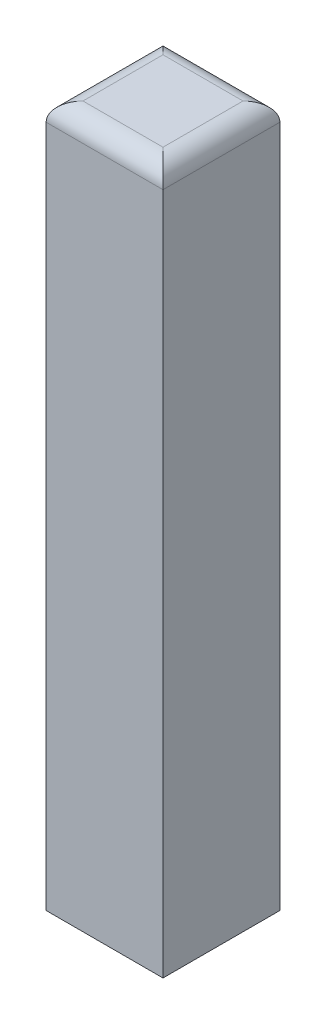
ISO-10303-21;
HEADER;
FILE_DESCRIPTION(('STEP AP214'),'2;1');
FILE_NAME('part.step','',(''),(''),'','','');
FILE_SCHEMA(('AUTOMOTIVE_DESIGN { 1 0 10303 214 1 1 1 1 }'));
ENDSEC;
DATA;
#1=APPLICATION_CONTEXT('core data for automotive mechanical design processes');
#2=APPLICATION_PROTOCOL_DEFINITION('international standard','automotive_design',2000,#1);
#3=PRODUCT_CONTEXT('',#1,'mechanical');
#4=PRODUCT('Part','Part','',(#3));
#5=PRODUCT_RELATED_PRODUCT_CATEGORY('part','',(#4));
#6=PRODUCT_DEFINITION_FORMATION('','',#4);
#7=PRODUCT_DEFINITION_CONTEXT('part definition',#1,'design');
#8=PRODUCT_DEFINITION('design','',#6,#7);
#9=PRODUCT_DEFINITION_SHAPE('','',#8);
#10=(LENGTH_UNIT() NAMED_UNIT(*) SI_UNIT(.MILLI.,.METRE.));
#11=(NAMED_UNIT(*) PLANE_ANGLE_UNIT() SI_UNIT($,.RADIAN.));
#12=(NAMED_UNIT(*) SI_UNIT($,.STERADIAN.) SOLID_ANGLE_UNIT());
#13=UNCERTAINTY_MEASURE_WITH_UNIT(LENGTH_MEASURE(1.E-05),#10,'distance_accuracy_value','');
#14=(GEOMETRIC_REPRESENTATION_CONTEXT(3) GLOBAL_UNCERTAINTY_ASSIGNED_CONTEXT((#13)) GLOBAL_UNIT_ASSIGNED_CONTEXT((#10,
#11,#12)) REPRESENTATION_CONTEXT('',''));
#15=CARTESIAN_POINT('',(0.,0.,0.));
#16=DIRECTION('',(0.,0.,1.));
#17=DIRECTION('',(1.,0.,0.));
#18=AXIS2_PLACEMENT_3D('',#15,#16,#17);
#19=CARTESIAN_POINT('',(0.,0.,127.));
#20=DIRECTION('',(0.,1.,0.));
#21=DIRECTION('',(0.,0.,1.));
#22=AXIS2_PLACEMENT_3D('',#19,#20,#21);
#23=PLANE('',#22);
#24=DIRECTION('',(1.,0.,0.));
#25=VECTOR('',#24,1.);
#26=CARTESIAN_POINT('',(0.,0.,0.));
#27=LINE('',#26,#25);
#28=CARTESIAN_POINT('',(0.,0.,0.));
#29=VERTEX_POINT('',#28);
#30=CARTESIAN_POINT('',(127.,0.,0.));
#31=VERTEX_POINT('',#30);
#32=EDGE_CURVE('E120',#29,#31,#27,.T.);
#33=ORIENTED_EDGE('',*,*,#32,.T.);
#34=DIRECTION('',(0.,0.,-1.));
#35=VECTOR('',#34,1.);
#36=CARTESIAN_POINT('',(127.,0.,127.));
#37=LINE('',#36,#35);
#38=CARTESIAN_POINT('',(127.,0.,127.));
#39=VERTEX_POINT('',#38);
#40=EDGE_CURVE('E103',#39,#31,#37,.T.);
#41=ORIENTED_EDGE('',*,*,#40,.F.);
#42=DIRECTION('',(1.,0.,0.));
#43=VECTOR('',#42,1.);
#44=CARTESIAN_POINT('',(0.,0.,127.));
#45=LINE('',#44,#43);
#46=CARTESIAN_POINT('',(0.,0.,127.));
#47=VERTEX_POINT('',#46);
#48=EDGE_CURVE('E109',#47,#39,#45,.T.);
#49=ORIENTED_EDGE('',*,*,#48,.F.);
#50=DIRECTION('',(0.,0.,-1.));
#51=VECTOR('',#50,1.);
#52=CARTESIAN_POINT('',(0.,0.,127.));
#53=LINE('',#52,#51);
#54=EDGE_CURVE('E123',#47,#29,#53,.T.);
#55=ORIENTED_EDGE('',*,*,#54,.T.);
#56=EDGE_LOOP('',(#33,#41,#49,#55));
#57=FACE_BOUND('',#56,.T.);
#58=ADVANCED_FACE('F43',(#57),#23,.F.);
#59=CARTESIAN_POINT('',(127.,0.,127.));
#60=DIRECTION('',(-1.,0.,0.));
#61=DIRECTION('',(0.,0.,1.));
#62=AXIS2_PLACEMENT_3D('',#59,#60,#61);
#63=PLANE('',#62);
#64=DIRECTION('',(0.,1.,0.));
#65=VECTOR('',#64,1.);
#66=CARTESIAN_POINT('',(127.,0.,0.));
#67=LINE('',#66,#65);
#68=CARTESIAN_POINT('',(127.,742.,0.));
#69=VERTEX_POINT('',#68);
#70=EDGE_CURVE('E165',#31,#69,#67,.T.);
#71=ORIENTED_EDGE('',*,*,#70,.T.);
#72=DIRECTION('',(0.,0.,-1.));
#73=VECTOR('',#72,1.);
#74=CARTESIAN_POINT('',(127.,742.,127.));
#75=LINE('',#74,#73);
#76=CARTESIAN_POINT('',(127.,742.,127.));
#77=VERTEX_POINT('',#76);
#78=EDGE_CURVE('E106',#69,#77,#75,.F.);
#79=ORIENTED_EDGE('',*,*,#78,.T.);
#80=DIRECTION('',(0.,1.,0.));
#81=VECTOR('',#80,1.);
#82=CARTESIAN_POINT('',(127.,0.,127.));
#83=LINE('',#82,#81);
#84=EDGE_CURVE('E98',#39,#77,#83,.T.);
#85=ORIENTED_EDGE('',*,*,#84,.F.);
#86=ORIENTED_EDGE('',*,*,#40,.T.);
#87=EDGE_LOOP('',(#71,#79,#85,#86));
#88=FACE_BOUND('',#87,.T.);
#89=ADVANCED_FACE('F101',(#88),#63,.F.);
#90=CARTESIAN_POINT('',(-2.61384973715095E-12,762.,127.));
#91=DIRECTION('',(0.,-1.,0.));
#92=DIRECTION('',(0.,0.,-1.));
#93=AXIS2_PLACEMENT_3D('',#90,#91,#92);
#94=PLANE('',#93);
#95=DIRECTION('',(-1.,0.,0.));
#96=VECTOR('',#95,1.);
#97=CARTESIAN_POINT('',(127.,762.,107.));
#98=LINE('',#97,#96);
#99=CARTESIAN_POINT('',(19.9999999999975,762.,107.));
#100=VERTEX_POINT('',#99);
#101=CARTESIAN_POINT('',(107.,762.,107.));
#102=VERTEX_POINT('',#101);
#103=EDGE_CURVE('E134',#100,#102,#98,.F.);
#104=ORIENTED_EDGE('',*,*,#103,.T.);
#105=DIRECTION('',(0.,0.,-1.));
#106=VECTOR('',#105,1.);
#107=CARTESIAN_POINT('',(107.,762.,127.));
#108=LINE('',#107,#106);
#109=CARTESIAN_POINT('',(107.,762.,20.));
#110=VERTEX_POINT('',#109);
#111=EDGE_CURVE('E137',#102,#110,#108,.T.);
#112=ORIENTED_EDGE('',*,*,#111,.T.);
#113=DIRECTION('',(-1.,0.,0.));
#114=VECTOR('',#113,1.);
#115=CARTESIAN_POINT('',(-2.61384973715095E-12,762.,20.));
#116=LINE('',#115,#114);
#117=CARTESIAN_POINT('',(19.9999999999975,762.,20.));
#118=VERTEX_POINT('',#117);
#119=EDGE_CURVE('E122',#110,#118,#116,.T.);
#120=ORIENTED_EDGE('',*,*,#119,.T.);
#121=DIRECTION('',(0.,0.,-1.));
#122=VECTOR('',#121,1.);
#123=CARTESIAN_POINT('',(19.9999999999975,762.,127.));
#124=LINE('',#123,#122);
#125=EDGE_CURVE('E127',#118,#100,#124,.F.);
#126=ORIENTED_EDGE('',*,*,#125,.T.);
#127=EDGE_LOOP('',(#104,#112,#120,#126));
#128=FACE_BOUND('',#127,.T.);
#129=ADVANCED_FACE('F182',(#128),#94,.F.);
#130=CARTESIAN_POINT('',(0.,0.,127.));
#131=DIRECTION('',(1.,0.,0.));
#132=DIRECTION('',(0.,1.,0.));
#133=AXIS2_PLACEMENT_3D('',#130,#131,#132);
#134=PLANE('',#133);
#135=DIRECTION('',(0.,-1.,0.));
#136=VECTOR('',#135,1.);
#137=CARTESIAN_POINT('',(0.,0.,127.));
#138=LINE('',#137,#136);
#139=CARTESIAN_POINT('',(-2.54524475717324E-12,742.,127.));
#140=VERTEX_POINT('',#139);
#141=EDGE_CURVE('E108',#140,#47,#138,.T.);
#142=ORIENTED_EDGE('',*,*,#141,.F.);
#143=DIRECTION('',(0.,0.,-1.));
#144=VECTOR('',#143,1.);
#145=CARTESIAN_POINT('',(-2.54524475717324E-12,742.,127.));
#146=LINE('',#145,#144);
#147=CARTESIAN_POINT('',(-2.54524475717324E-12,742.,0.));
#148=VERTEX_POINT('',#147);
#149=EDGE_CURVE('E53',#140,#148,#146,.T.);
#150=ORIENTED_EDGE('',*,*,#149,.T.);
#151=DIRECTION('',(0.,-1.,0.));
#152=VECTOR('',#151,1.);
#153=CARTESIAN_POINT('',(0.,0.,0.));
#154=LINE('',#153,#152);
#155=EDGE_CURVE('E117',#148,#29,#154,.T.);
#156=ORIENTED_EDGE('',*,*,#155,.T.);
#157=ORIENTED_EDGE('',*,*,#54,.F.);
#158=EDGE_LOOP('',(#142,#150,#156,#157));
#159=FACE_BOUND('',#158,.T.);
#160=ADVANCED_FACE('F171',(#159),#134,.F.);
#161=CARTESIAN_POINT('',(0.,0.,127.));
#162=DIRECTION('',(0.,0.,1.));
#163=DIRECTION('',(1.,0.,0.));
#164=AXIS2_PLACEMENT_3D('',#161,#162,#163);
#165=PLANE('',#164);
#166=ORIENTED_EDGE('',*,*,#84,.T.);
#167=DIRECTION('',(-1.,0.,0.));
#168=VECTOR('',#167,1.);
#169=CARTESIAN_POINT('',(-2.61384973715095E-12,742.,127.));
#170=LINE('',#169,#168);
#171=EDGE_CURVE('E68',#77,#140,#170,.T.);
#172=ORIENTED_EDGE('',*,*,#171,.T.);
#173=ORIENTED_EDGE('',*,*,#141,.T.);
#174=ORIENTED_EDGE('',*,*,#48,.T.);
#175=EDGE_LOOP('',(#166,#172,#173,#174));
#176=FACE_BOUND('',#175,.T.);
#177=ADVANCED_FACE('F112',(#176),#165,.T.);
#178=CARTESIAN_POINT('',(0.,0.,0.));
#179=DIRECTION('',(0.,0.,1.));
#180=DIRECTION('',(1.,0.,0.));
#181=AXIS2_PLACEMENT_3D('',#178,#179,#180);
#182=PLANE('',#181);
#183=ORIENTED_EDGE('',*,*,#155,.F.);
#184=DIRECTION('',(-1.,0.,0.));
#185=VECTOR('',#184,1.);
#186=CARTESIAN_POINT('',(0.,742.,0.));
#187=LINE('',#186,#185);
#188=EDGE_CURVE('E11',#148,#69,#187,.F.);
#189=ORIENTED_EDGE('',*,*,#188,.T.);
#190=ORIENTED_EDGE('',*,*,#70,.F.);
#191=ORIENTED_EDGE('',*,*,#32,.F.);
#192=EDGE_LOOP('',(#183,#189,#190,#191));
#193=FACE_BOUND('',#192,.T.);
#194=ADVANCED_FACE('F173',(#193),#182,.F.);
#195=CARTESIAN_POINT('',(19.9999999999975,742.,127.));
#196=DIRECTION('',(0.,0.,-1.));
#197=DIRECTION('',(-1.,0.,0.));
#198=AXIS2_PLACEMENT_3D('',#195,#196,#197);
#199=CYLINDRICAL_SURFACE('',#198,20.);
#200=CARTESIAN_POINT('',(19.9999999999975,742.,20.));
#201=DIRECTION('',(-0.707106781186547,0.,0.707106781186547));
#202=DIRECTION('',(-0.707106781186547,0.,-0.707106781186547));
#203=AXIS2_PLACEMENT_3D('',#200,#201,#202);
#204=ELLIPSE('',#203,28.2842712474619,20.);
#205=EDGE_CURVE('E152',#148,#118,#204,.F.);
#206=ORIENTED_EDGE('',*,*,#205,.F.);
#207=ORIENTED_EDGE('',*,*,#149,.F.);
#208=CARTESIAN_POINT('',(19.9999999999975,742.,107.));
#209=DIRECTION('',(-0.707106781186547,0.,-0.707106781186547));
#210=DIRECTION('',(0.707106781186547,0.,-0.707106781186547));
#211=AXIS2_PLACEMENT_3D('',#208,#209,#210);
#212=ELLIPSE('',#211,28.2842712474619,20.);
#213=EDGE_CURVE('E47',#100,#140,#212,.F.);
#214=ORIENTED_EDGE('',*,*,#213,.F.);
#215=ORIENTED_EDGE('',*,*,#125,.F.);
#216=EDGE_LOOP('',(#206,#207,#214,#215));
#217=FACE_BOUND('',#216,.T.);
#218=ADVANCED_FACE('F45',(#217),#199,.T.);
#219=CARTESIAN_POINT('',(0.,742.,107.));
#220=DIRECTION('',(1.,0.,0.));
#221=DIRECTION('',(0.,0.,-1.));
#222=AXIS2_PLACEMENT_3D('',#219,#220,#221);
#223=CYLINDRICAL_SURFACE('',#222,20.);
#224=ORIENTED_EDGE('',*,*,#213,.T.);
#225=ORIENTED_EDGE('',*,*,#171,.F.);
#226=CARTESIAN_POINT('',(107.,742.,107.));
#227=DIRECTION('',(0.707106781186547,0.,-0.707106781186547));
#228=DIRECTION('',(0.707106781186547,0.,0.707106781186547));
#229=AXIS2_PLACEMENT_3D('',#226,#227,#228);
#230=ELLIPSE('',#229,28.2842712474619,20.);
#231=EDGE_CURVE('E150',#102,#77,#230,.T.);
#232=ORIENTED_EDGE('',*,*,#231,.F.);
#233=ORIENTED_EDGE('',*,*,#103,.F.);
#234=EDGE_LOOP('',(#224,#225,#232,#233));
#235=FACE_BOUND('',#234,.T.);
#236=ADVANCED_FACE('F183',(#235),#223,.T.);
#237=CARTESIAN_POINT('',(-2.61384973715095E-12,742.,20.));
#238=DIRECTION('',(-1.,0.,0.));
#239=DIRECTION('',(0.,0.,1.));
#240=AXIS2_PLACEMENT_3D('',#237,#238,#239);
#241=CYLINDRICAL_SURFACE('',#240,20.);
#242=ORIENTED_EDGE('',*,*,#205,.T.);
#243=ORIENTED_EDGE('',*,*,#119,.F.);
#244=CARTESIAN_POINT('',(107.,742.,20.));
#245=DIRECTION('',(-0.707106781186547,0.,-0.707106781186547));
#246=DIRECTION('',(-0.707106781186547,0.,0.707106781186547));
#247=AXIS2_PLACEMENT_3D('',#244,#245,#246);
#248=ELLIPSE('',#247,28.2842712474619,20.);
#249=EDGE_CURVE('E147',#69,#110,#248,.F.);
#250=ORIENTED_EDGE('',*,*,#249,.F.);
#251=ORIENTED_EDGE('',*,*,#188,.F.);
#252=EDGE_LOOP('',(#242,#243,#250,#251));
#253=FACE_BOUND('',#252,.T.);
#254=ADVANCED_FACE('F179',(#253),#241,.T.);
#255=CARTESIAN_POINT('',(107.,742.,127.));
#256=DIRECTION('',(0.,0.,-1.));
#257=DIRECTION('',(-1.,0.,0.));
#258=AXIS2_PLACEMENT_3D('',#255,#256,#257);
#259=CYLINDRICAL_SURFACE('',#258,20.);
#260=ORIENTED_EDGE('',*,*,#231,.T.);
#261=ORIENTED_EDGE('',*,*,#78,.F.);
#262=ORIENTED_EDGE('',*,*,#249,.T.);
#263=ORIENTED_EDGE('',*,*,#111,.F.);
#264=EDGE_LOOP('',(#260,#261,#262,#263));
#265=FACE_BOUND('',#264,.T.);
#266=ADVANCED_FACE('F176',(#265),#259,.T.);
#267=CLOSED_SHELL('',(#58,#89,#129,#160,#177,#194,#218,#236,#254,#266));
#268=MANIFOLD_SOLID_BREP('B2',#267);
#269=ADVANCED_BREP_SHAPE_REPRESENTATION('',(#18,#268),#14);
#270=SHAPE_DEFINITION_REPRESENTATION(#9,#269);
ENDSEC;
END-ISO-10303-21;
